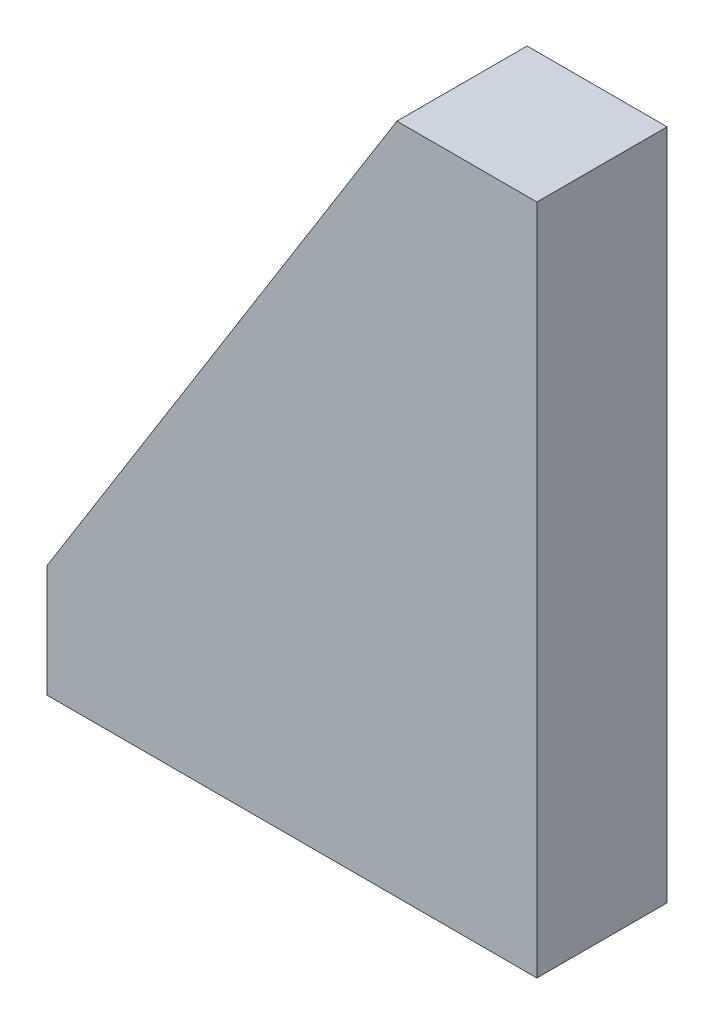
ISO-10303-21;
HEADER;
FILE_DESCRIPTION(('STEP AP214'),'2;1');
FILE_NAME('part.step','',(''),(''),'','','');
FILE_SCHEMA(('AUTOMOTIVE_DESIGN { 1 0 10303 214 1 1 1 1 }'));
ENDSEC;
DATA;
#1=APPLICATION_CONTEXT('core data for automotive mechanical design processes');
#2=APPLICATION_PROTOCOL_DEFINITION('international standard','automotive_design',2000,#1);
#3=PRODUCT_CONTEXT('',#1,'mechanical');
#4=PRODUCT('Part','Part','',(#3));
#5=PRODUCT_RELATED_PRODUCT_CATEGORY('part','',(#4));
#6=PRODUCT_DEFINITION_FORMATION('','',#4);
#7=PRODUCT_DEFINITION_CONTEXT('part definition',#1,'design');
#8=PRODUCT_DEFINITION('design','',#6,#7);
#9=PRODUCT_DEFINITION_SHAPE('','',#8);
#10=(LENGTH_UNIT() NAMED_UNIT(*) SI_UNIT(.MILLI.,.METRE.));
#11=(NAMED_UNIT(*) PLANE_ANGLE_UNIT() SI_UNIT($,.RADIAN.));
#12=(NAMED_UNIT(*) SI_UNIT($,.STERADIAN.) SOLID_ANGLE_UNIT());
#13=UNCERTAINTY_MEASURE_WITH_UNIT(LENGTH_MEASURE(1.E-05),#10,'distance_accuracy_value','');
#14=(GEOMETRIC_REPRESENTATION_CONTEXT(3) GLOBAL_UNCERTAINTY_ASSIGNED_CONTEXT((#13)) GLOBAL_UNIT_ASSIGNED_CONTEXT((#10,
#11,#12)) REPRESENTATION_CONTEXT('',''));
#15=CARTESIAN_POINT('',(0.,0.,0.));
#16=DIRECTION('',(0.,0.,1.));
#17=DIRECTION('',(1.,0.,0.));
#18=AXIS2_PLACEMENT_3D('',#15,#16,#17);
#19=CARTESIAN_POINT('',(-35.,2.,-9.3));
#20=DIRECTION('',(-1.,0.,0.));
#21=DIRECTION('',(0.,0.,1.));
#22=AXIS2_PLACEMENT_3D('',#19,#20,#21);
#23=PLANE('',#22);
#24=DIRECTION('',(0.,-1.,0.));
#25=VECTOR('',#24,1.);
#26=CARTESIAN_POINT('',(-35.,2.,0.));
#27=LINE('',#26,#25);
#28=CARTESIAN_POINT('',(-35.,2.,0.));
#29=VERTEX_POINT('',#28);
#30=CARTESIAN_POINT('',(-35.,-6.,0.));
#31=VERTEX_POINT('',#30);
#32=EDGE_CURVE('E85',#29,#31,#27,.T.);
#33=ORIENTED_EDGE('',*,*,#32,.F.);
#34=DIRECTION('',(0.,0.,1.));
#35=VECTOR('',#34,1.);
#36=CARTESIAN_POINT('',(-35.,2.,-9.3));
#37=LINE('',#36,#35);
#38=CARTESIAN_POINT('',(-35.,2.,-9.3));
#39=VERTEX_POINT('',#38);
#40=EDGE_CURVE('E11',#39,#29,#37,.T.);
#41=ORIENTED_EDGE('',*,*,#40,.F.);
#42=DIRECTION('',(0.,-1.,0.));
#43=VECTOR('',#42,1.);
#44=CARTESIAN_POINT('',(-35.,2.,-9.3));
#45=LINE('',#44,#43);
#46=CARTESIAN_POINT('',(-35.,-6.,-9.3));
#47=VERTEX_POINT('',#46);
#48=EDGE_CURVE('E98',#39,#47,#45,.T.);
#49=ORIENTED_EDGE('',*,*,#48,.T.);
#50=DIRECTION('',(0.,0.,1.));
#51=VECTOR('',#50,1.);
#52=CARTESIAN_POINT('',(-35.,-6.,-44.8105618091294));
#53=LINE('',#52,#51);
#54=EDGE_CURVE('E96',#47,#31,#53,.T.);
#55=ORIENTED_EDGE('',*,*,#54,.T.);
#56=EDGE_LOOP('',(#33,#41,#49,#55));
#57=FACE_BOUND('',#56,.T.);
#58=ADVANCED_FACE('F36',(#57),#23,.T.);
#59=CARTESIAN_POINT('',(-10.,42.,-9.3));
#60=DIRECTION('',(-0.847998304005088,0.52999894000318,0.));
#61=DIRECTION('',(-0.52999894000318,-0.847998304005088,0.));
#62=AXIS2_PLACEMENT_3D('',#59,#60,#61);
#63=PLANE('',#62);
#64=DIRECTION('',(-0.52999894000318,-0.847998304005088,0.));
#65=VECTOR('',#64,1.);
#66=CARTESIAN_POINT('',(-10.,42.,0.));
#67=LINE('',#66,#65);
#68=CARTESIAN_POINT('',(-10.,42.,0.));
#69=VERTEX_POINT('',#68);
#70=EDGE_CURVE('E92',#69,#29,#67,.T.);
#71=ORIENTED_EDGE('',*,*,#70,.F.);
#72=DIRECTION('',(0.,0.,1.));
#73=VECTOR('',#72,1.);
#74=CARTESIAN_POINT('',(-10.,42.,-9.3));
#75=LINE('',#74,#73);
#76=CARTESIAN_POINT('',(-10.,42.,-9.3));
#77=VERTEX_POINT('',#76);
#78=EDGE_CURVE('E46',#77,#69,#75,.T.);
#79=ORIENTED_EDGE('',*,*,#78,.F.);
#80=DIRECTION('',(-0.52999894000318,-0.847998304005088,0.));
#81=VECTOR('',#80,1.);
#82=CARTESIAN_POINT('',(-10.,42.,-9.3));
#83=LINE('',#82,#81);
#84=EDGE_CURVE('E117',#77,#39,#83,.T.);
#85=ORIENTED_EDGE('',*,*,#84,.T.);
#86=ORIENTED_EDGE('',*,*,#40,.T.);
#87=EDGE_LOOP('',(#71,#79,#85,#86));
#88=FACE_BOUND('',#87,.T.);
#89=ADVANCED_FACE('F126',(#88),#63,.T.);
#90=CARTESIAN_POINT('',(0.,42.,-9.3));
#91=DIRECTION('',(0.,1.,0.));
#92=DIRECTION('',(0.,0.,1.));
#93=AXIS2_PLACEMENT_3D('',#90,#91,#92);
#94=PLANE('',#93);
#95=DIRECTION('',(-1.,0.,0.));
#96=VECTOR('',#95,1.);
#97=CARTESIAN_POINT('',(0.,42.,0.));
#98=LINE('',#97,#96);
#99=CARTESIAN_POINT('',(0.,42.,0.));
#100=VERTEX_POINT('',#99);
#101=EDGE_CURVE('E121',#100,#69,#98,.T.);
#102=ORIENTED_EDGE('',*,*,#101,.F.);
#103=DIRECTION('',(0.,0.,1.));
#104=VECTOR('',#103,1.);
#105=CARTESIAN_POINT('',(0.,42.,-9.3));
#106=LINE('',#105,#104);
#107=CARTESIAN_POINT('',(0.,42.,-9.3));
#108=VERTEX_POINT('',#107);
#109=EDGE_CURVE('E40',#108,#100,#106,.T.);
#110=ORIENTED_EDGE('',*,*,#109,.F.);
#111=DIRECTION('',(-1.,0.,0.));
#112=VECTOR('',#111,1.);
#113=CARTESIAN_POINT('',(0.,42.,-9.3));
#114=LINE('',#113,#112);
#115=EDGE_CURVE('E115',#108,#77,#114,.T.);
#116=ORIENTED_EDGE('',*,*,#115,.T.);
#117=ORIENTED_EDGE('',*,*,#78,.T.);
#118=EDGE_LOOP('',(#102,#110,#116,#117));
#119=FACE_BOUND('',#118,.T.);
#120=ADVANCED_FACE('F124',(#119),#94,.T.);
#121=CARTESIAN_POINT('',(0.,0.,-9.3));
#122=DIRECTION('',(1.,0.,0.));
#123=DIRECTION('',(0.,0.,-1.));
#124=AXIS2_PLACEMENT_3D('',#121,#122,#123);
#125=PLANE('',#124);
#126=DIRECTION('',(0.,1.,0.));
#127=VECTOR('',#126,1.);
#128=CARTESIAN_POINT('',(0.,0.,0.));
#129=LINE('',#128,#127);
#130=CARTESIAN_POINT('',(0.,-6.,0.));
#131=VERTEX_POINT('',#130);
#132=EDGE_CURVE('E112',#131,#100,#129,.T.);
#133=ORIENTED_EDGE('',*,*,#132,.F.);
#134=DIRECTION('',(0.,0.,1.));
#135=VECTOR('',#134,1.);
#136=CARTESIAN_POINT('',(0.,-6.,-44.8105618091294));
#137=LINE('',#136,#135);
#138=CARTESIAN_POINT('',(0.,-6.,-9.30000000000002));
#139=VERTEX_POINT('',#138);
#140=EDGE_CURVE('E102',#139,#131,#137,.T.);
#141=ORIENTED_EDGE('',*,*,#140,.F.);
#142=DIRECTION('',(0.,1.,0.));
#143=VECTOR('',#142,1.);
#144=CARTESIAN_POINT('',(0.,0.,-9.3));
#145=LINE('',#144,#143);
#146=EDGE_CURVE('E93',#139,#108,#145,.T.);
#147=ORIENTED_EDGE('',*,*,#146,.T.);
#148=ORIENTED_EDGE('',*,*,#109,.T.);
#149=EDGE_LOOP('',(#133,#141,#147,#148));
#150=FACE_BOUND('',#149,.T.);
#151=ADVANCED_FACE('F38',(#150),#125,.T.);
#152=CARTESIAN_POINT('',(0.,0.,-9.3));
#153=DIRECTION('',(0.,0.,1.));
#154=DIRECTION('',(1.,0.,0.));
#155=AXIS2_PLACEMENT_3D('',#152,#153,#154);
#156=PLANE('',#155);
#157=ORIENTED_EDGE('',*,*,#146,.F.);
#158=DIRECTION('',(-1.,0.,0.));
#159=VECTOR('',#158,1.);
#160=CARTESIAN_POINT('',(0.,-6.,-9.3));
#161=LINE('',#160,#159);
#162=EDGE_CURVE('E109',#139,#47,#161,.T.);
#163=ORIENTED_EDGE('',*,*,#162,.T.);
#164=ORIENTED_EDGE('',*,*,#48,.F.);
#165=ORIENTED_EDGE('',*,*,#84,.F.);
#166=ORIENTED_EDGE('',*,*,#115,.F.);
#167=EDGE_LOOP('',(#157,#163,#164,#165,#166));
#168=FACE_BOUND('',#167,.T.);
#169=ADVANCED_FACE('F131',(#168),#156,.F.);
#170=CARTESIAN_POINT('',(0.,0.,0.));
#171=DIRECTION('',(0.,0.,1.));
#172=DIRECTION('',(1.,0.,0.));
#173=AXIS2_PLACEMENT_3D('',#170,#171,#172);
#174=PLANE('',#173);
#175=ORIENTED_EDGE('',*,*,#32,.T.);
#176=DIRECTION('',(1.,0.,0.));
#177=VECTOR('',#176,1.);
#178=CARTESIAN_POINT('',(0.,-6.,0.));
#179=LINE('',#178,#177);
#180=EDGE_CURVE('E90',#31,#131,#179,.T.);
#181=ORIENTED_EDGE('',*,*,#180,.T.);
#182=ORIENTED_EDGE('',*,*,#132,.T.);
#183=ORIENTED_EDGE('',*,*,#101,.T.);
#184=ORIENTED_EDGE('',*,*,#70,.T.);
#185=EDGE_LOOP('',(#175,#181,#182,#183,#184));
#186=FACE_BOUND('',#185,.T.);
#187=ADVANCED_FACE('F87',(#186),#174,.T.);
#188=CARTESIAN_POINT('',(0.,-6.,-44.8105618091294));
#189=DIRECTION('',(0.,-1.,0.));
#190=DIRECTION('',(1.,0.,0.));
#191=AXIS2_PLACEMENT_3D('',#188,#189,#190);
#192=PLANE('',#191);
#193=ORIENTED_EDGE('',*,*,#162,.F.);
#194=ORIENTED_EDGE('',*,*,#140,.T.);
#195=ORIENTED_EDGE('',*,*,#180,.F.);
#196=ORIENTED_EDGE('',*,*,#54,.F.);
#197=EDGE_LOOP('',(#193,#194,#195,#196));
#198=FACE_BOUND('',#197,.T.);
#199=ADVANCED_FACE('F105',(#198),#192,.T.);
#200=CLOSED_SHELL('',(#58,#89,#120,#151,#169,#187,#199));
#201=MANIFOLD_SOLID_BREP('B2',#200);
#202=ADVANCED_BREP_SHAPE_REPRESENTATION('',(#18,#201),#14);
#203=SHAPE_DEFINITION_REPRESENTATION(#9,#202);
ENDSEC;
END-ISO-10303-21;
